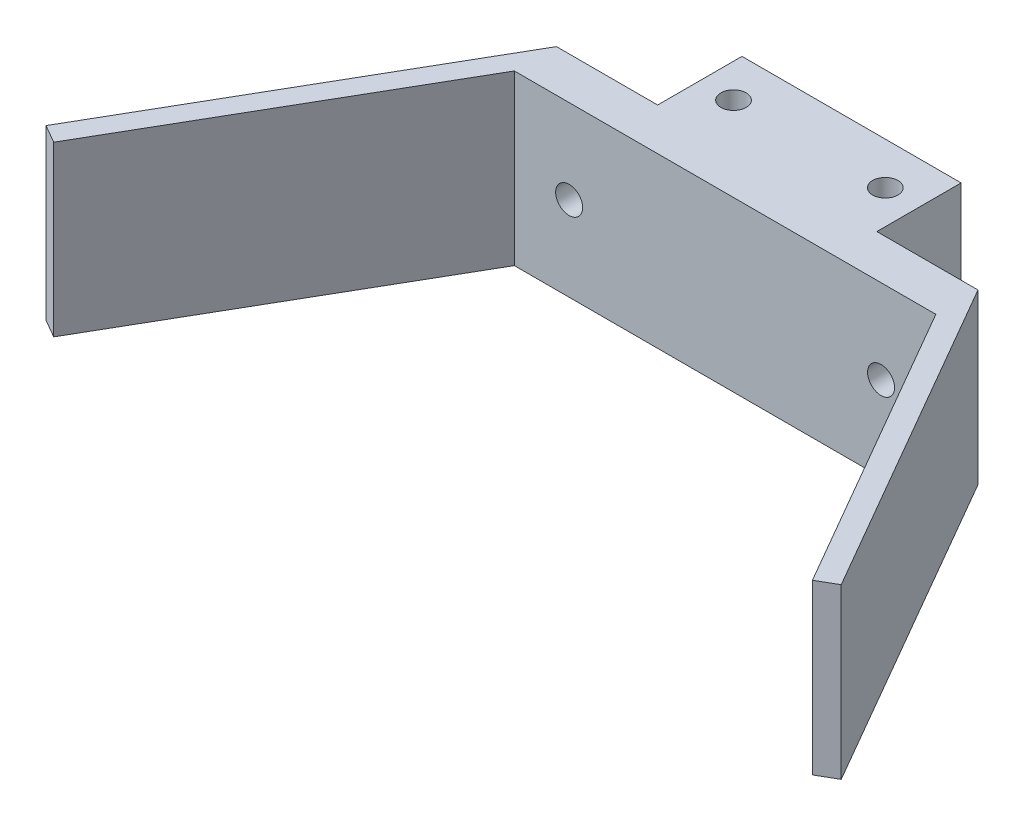
ISO-10303-21;
HEADER;
FILE_DESCRIPTION(('STEP AP214'),'2;1');
FILE_NAME('part.step','',(''),(''),'','','');
FILE_SCHEMA(('AUTOMOTIVE_DESIGN { 1 0 10303 214 1 1 1 1 }'));
ENDSEC;
DATA;
#1=APPLICATION_CONTEXT('core data for automotive mechanical design processes');
#2=APPLICATION_PROTOCOL_DEFINITION('international standard','automotive_design',2000,#1);
#3=PRODUCT_CONTEXT('',#1,'mechanical');
#4=PRODUCT('Part','Part','',(#3));
#5=PRODUCT_RELATED_PRODUCT_CATEGORY('part','',(#4));
#6=PRODUCT_DEFINITION_FORMATION('','',#4);
#7=PRODUCT_DEFINITION_CONTEXT('part definition',#1,'design');
#8=PRODUCT_DEFINITION('design','',#6,#7);
#9=PRODUCT_DEFINITION_SHAPE('','',#8);
#10=(LENGTH_UNIT() NAMED_UNIT(*) SI_UNIT(.MILLI.,.METRE.));
#11=(NAMED_UNIT(*) PLANE_ANGLE_UNIT() SI_UNIT($,.RADIAN.));
#12=(NAMED_UNIT(*) SI_UNIT($,.STERADIAN.) SOLID_ANGLE_UNIT());
#13=UNCERTAINTY_MEASURE_WITH_UNIT(LENGTH_MEASURE(1.E-05),#10,'distance_accuracy_value','');
#14=(GEOMETRIC_REPRESENTATION_CONTEXT(3) GLOBAL_UNCERTAINTY_ASSIGNED_CONTEXT((#13)) GLOBAL_UNIT_ASSIGNED_CONTEXT((#10,
#11,#12)) REPRESENTATION_CONTEXT('',''));
#15=CARTESIAN_POINT('',(0.,0.,0.));
#16=DIRECTION('',(0.,0.,1.));
#17=DIRECTION('',(1.,0.,0.));
#18=AXIS2_PLACEMENT_3D('',#15,#16,#17);
#19=CARTESIAN_POINT('',(25.,10.,0.));
#20=DIRECTION('',(0.,0.,-1.));
#21=DIRECTION('',(-1.,0.,0.));
#22=AXIS2_PLACEMENT_3D('',#19,#20,#21);
#23=PLANE('',#22);
#24=CARTESIAN_POINT('',(18.5,0.,0.));
#25=DIRECTION('',(0.,0.,1.));
#26=DIRECTION('',(-1.,0.,0.));
#27=AXIS2_PLACEMENT_3D('',#24,#25,#26);
#28=CIRCLE('',#27,1.6);
#29=CARTESIAN_POINT('',(16.9,0.,0.));
#30=VERTEX_POINT('',#29);
#31=EDGE_CURVE('E210',#30,#30,#28,.T.);
#32=ORIENTED_EDGE('',*,*,#31,.T.);
#33=EDGE_LOOP('',(#32));
#34=FACE_BOUND('',#33,.T.);
#35=DIRECTION('',(1.,0.,0.));
#36=VECTOR('',#35,1.);
#37=CARTESIAN_POINT('',(-25.,-10.,0.));
#38=LINE('',#37,#36);
#39=CARTESIAN_POINT('',(13.,-10.,0.));
#40=VERTEX_POINT('',#39);
#41=CARTESIAN_POINT('',(25.,-10.,0.));
#42=VERTEX_POINT('',#41);
#43=EDGE_CURVE('E242',#40,#42,#38,.T.);
#44=ORIENTED_EDGE('',*,*,#43,.F.);
#45=DIRECTION('',(0.,1.,0.));
#46=VECTOR('',#45,1.);
#47=CARTESIAN_POINT('',(13.,-10.,0.));
#48=LINE('',#47,#46);
#49=CARTESIAN_POINT('',(13.,10.,0.));
#50=VERTEX_POINT('',#49);
#51=EDGE_CURVE('E150',#40,#50,#48,.T.);
#52=ORIENTED_EDGE('',*,*,#51,.T.);
#53=DIRECTION('',(-1.,0.,0.));
#54=VECTOR('',#53,1.);
#55=CARTESIAN_POINT('',(-25.,10.,0.));
#56=LINE('',#55,#54);
#57=CARTESIAN_POINT('',(25.,10.,0.));
#58=VERTEX_POINT('',#57);
#59=EDGE_CURVE('E239',#58,#50,#56,.T.);
#60=ORIENTED_EDGE('',*,*,#59,.F.);
#61=DIRECTION('',(0.,1.,0.));
#62=VECTOR('',#61,1.);
#63=CARTESIAN_POINT('',(25.,-10.,0.));
#64=LINE('',#63,#62);
#65=EDGE_CURVE('E221',#42,#58,#64,.T.);
#66=ORIENTED_EDGE('',*,*,#65,.F.);
#67=EDGE_LOOP('',(#44,#52,#60,#66));
#68=FACE_BOUND('',#67,.T.);
#69=ADVANCED_FACE('F31',(#34,#68),#23,.T.);
#70=CARTESIAN_POINT('',(25.,10.,5.));
#71=DIRECTION('',(0.,0.,-1.));
#72=DIRECTION('',(-1.,0.,0.));
#73=AXIS2_PLACEMENT_3D('',#70,#71,#72);
#74=PLANE('',#73);
#75=CARTESIAN_POINT('',(-18.5,0.,5.));
#76=DIRECTION('',(0.,0.,1.));
#77=DIRECTION('',(1.,0.,0.));
#78=AXIS2_PLACEMENT_3D('',#75,#76,#77);
#79=CIRCLE('',#78,1.6);
#80=CARTESIAN_POINT('',(-16.9,0.,5.));
#81=VERTEX_POINT('',#80);
#82=EDGE_CURVE('E218',#81,#81,#79,.T.);
#83=ORIENTED_EDGE('',*,*,#82,.F.);
#84=EDGE_LOOP('',(#83));
#85=FACE_BOUND('',#84,.T.);
#86=DIRECTION('',(0.,1.,0.));
#87=VECTOR('',#86,1.);
#88=CARTESIAN_POINT('',(25.,-10.,5.));
#89=LINE('',#88,#87);
#90=CARTESIAN_POINT('',(25.,-10.,5.));
#91=VERTEX_POINT('',#90);
#92=CARTESIAN_POINT('',(25.,10.,5.));
#93=VERTEX_POINT('',#92);
#94=EDGE_CURVE('E224',#91,#93,#89,.T.);
#95=ORIENTED_EDGE('',*,*,#94,.T.);
#96=DIRECTION('',(-1.,0.,0.));
#97=VECTOR('',#96,1.);
#98=CARTESIAN_POINT('',(-25.,10.,5.));
#99=LINE('',#98,#97);
#100=CARTESIAN_POINT('',(-25.,10.,5.));
#101=VERTEX_POINT('',#100);
#102=EDGE_CURVE('E79',#93,#101,#99,.T.);
#103=ORIENTED_EDGE('',*,*,#102,.T.);
#104=DIRECTION('',(0.,-1.,0.));
#105=VECTOR('',#104,1.);
#106=CARTESIAN_POINT('',(-25.,-10.,5.));
#107=LINE('',#106,#105);
#108=CARTESIAN_POINT('',(-25.,-10.,5.));
#109=VERTEX_POINT('',#108);
#110=EDGE_CURVE('E40',#101,#109,#107,.T.);
#111=ORIENTED_EDGE('',*,*,#110,.T.);
#112=DIRECTION('',(1.,0.,0.));
#113=VECTOR('',#112,1.);
#114=CARTESIAN_POINT('',(-25.,-10.,5.));
#115=LINE('',#114,#113);
#116=EDGE_CURVE('E11',#109,#91,#115,.T.);
#117=ORIENTED_EDGE('',*,*,#116,.T.);
#118=EDGE_LOOP('',(#95,#103,#111,#117));
#119=FACE_BOUND('',#118,.T.);
#120=CARTESIAN_POINT('',(18.5,0.,5.));
#121=DIRECTION('',(0.,0.,1.));
#122=DIRECTION('',(-1.,0.,0.));
#123=AXIS2_PLACEMENT_3D('',#120,#121,#122);
#124=CIRCLE('',#123,1.6);
#125=CARTESIAN_POINT('',(16.9,0.,5.));
#126=VERTEX_POINT('',#125);
#127=EDGE_CURVE('E212',#126,#126,#124,.T.);
#128=ORIENTED_EDGE('',*,*,#127,.F.);
#129=EDGE_LOOP('',(#128));
#130=FACE_BOUND('',#129,.T.);
#131=ADVANCED_FACE('F271',(#85,#119,#130),#74,.F.);
#132=DIRECTION('',(0.,1.,0.));
#133=VECTOR('',#132,1.);
#134=CARTESIAN_POINT('',(-13.,-10.,0.));
#135=LINE('',#134,#133);
#136=CARTESIAN_POINT('',(-13.,-10.,0.));
#137=VERTEX_POINT('',#136);
#138=CARTESIAN_POINT('',(-13.,10.,0.));
#139=VERTEX_POINT('',#138);
#140=EDGE_CURVE('E160',#137,#139,#135,.T.);
#141=ORIENTED_EDGE('',*,*,#140,.F.);
#142=CARTESIAN_POINT('',(-25.,-10.,0.));
#143=VERTEX_POINT('',#142);
#144=EDGE_CURVE('E71',#143,#137,#38,.T.);
#145=ORIENTED_EDGE('',*,*,#144,.F.);
#146=DIRECTION('',(0.,-1.,0.));
#147=VECTOR('',#146,1.);
#148=CARTESIAN_POINT('',(-25.,-10.,0.));
#149=LINE('',#148,#147);
#150=CARTESIAN_POINT('',(-25.,10.,0.));
#151=VERTEX_POINT('',#150);
#152=EDGE_CURVE('E233',#151,#143,#149,.T.);
#153=ORIENTED_EDGE('',*,*,#152,.F.);
#154=EDGE_CURVE('E230',#139,#151,#56,.T.);
#155=ORIENTED_EDGE('',*,*,#154,.F.);
#156=EDGE_LOOP('',(#141,#145,#153,#155));
#157=FACE_BOUND('',#156,.T.);
#158=CARTESIAN_POINT('',(-18.5,0.,0.));
#159=DIRECTION('',(0.,0.,1.));
#160=DIRECTION('',(1.,0.,0.));
#161=AXIS2_PLACEMENT_3D('',#158,#159,#160);
#162=CIRCLE('',#161,1.6);
#163=CARTESIAN_POINT('',(-16.9,0.,0.));
#164=VERTEX_POINT('',#163);
#165=EDGE_CURVE('E215',#164,#164,#162,.T.);
#166=ORIENTED_EDGE('',*,*,#165,.T.);
#167=EDGE_LOOP('',(#166));
#168=FACE_BOUND('',#167,.T.);
#169=ADVANCED_FACE('F253',(#157,#168),#23,.T.);
#170=CARTESIAN_POINT('',(-25.,10.,5.));
#171=DIRECTION('',(0.,-1.,0.));
#172=DIRECTION('',(0.,0.,-1.));
#173=AXIS2_PLACEMENT_3D('',#170,#171,#172);
#174=PLANE('',#173);
#175=ORIENTED_EDGE('',*,*,#59,.T.);
#176=DIRECTION('',(0.,0.,-1.));
#177=VECTOR('',#176,1.);
#178=CARTESIAN_POINT('',(13.,10.,-10.));
#179=LINE('',#178,#177);
#180=CARTESIAN_POINT('',(13.,10.,-10.));
#181=VERTEX_POINT('',#180);
#182=EDGE_CURVE('E48',#50,#181,#179,.T.);
#183=ORIENTED_EDGE('',*,*,#182,.T.);
#184=DIRECTION('',(-1.,0.,0.));
#185=VECTOR('',#184,1.);
#186=CARTESIAN_POINT('',(-13.,10.,-10.));
#187=LINE('',#186,#185);
#188=CARTESIAN_POINT('',(-13.,10.,-10.));
#189=VERTEX_POINT('',#188);
#190=EDGE_CURVE('E136',#181,#189,#187,.T.);
#191=ORIENTED_EDGE('',*,*,#190,.T.);
#192=DIRECTION('',(0.,0.,1.));
#193=VECTOR('',#192,1.);
#194=CARTESIAN_POINT('',(-13.,10.,-10.));
#195=LINE('',#194,#193);
#196=EDGE_CURVE('E151',#189,#139,#195,.T.);
#197=ORIENTED_EDGE('',*,*,#196,.T.);
#198=ORIENTED_EDGE('',*,*,#154,.T.);
#199=DIRECTION('',(-0.500000000000001,0.,0.866025403784438));
#200=VECTOR('',#199,1.);
#201=CARTESIAN_POINT('',(-47.1650635094612,10.,38.3910161513775));
#202=LINE('',#201,#200);
#203=CARTESIAN_POINT('',(-47.1650635094612,10.,38.3910161513775));
#204=VERTEX_POINT('',#203);
#205=EDGE_CURVE('E182',#151,#204,#202,.T.);
#206=ORIENTED_EDGE('',*,*,#205,.T.);
#207=DIRECTION('',(0.866025403784438,0.,0.500000000000002));
#208=VECTOR('',#207,1.);
#209=CARTESIAN_POINT('',(-45.0000000000001,10.,39.6410161513775));
#210=LINE('',#209,#208);
#211=CARTESIAN_POINT('',(-45.0000000000001,10.,39.6410161513775));
#212=VERTEX_POINT('',#211);
#213=EDGE_CURVE('E173',#204,#212,#210,.T.);
#214=ORIENTED_EDGE('',*,*,#213,.T.);
#215=DIRECTION('',(0.500000000000001,0.,-0.866025403784438));
#216=VECTOR('',#215,1.);
#217=CARTESIAN_POINT('',(-25.,10.,5.));
#218=LINE('',#217,#216);
#219=EDGE_CURVE('E180',#212,#101,#218,.T.);
#220=ORIENTED_EDGE('',*,*,#219,.T.);
#221=ORIENTED_EDGE('',*,*,#102,.F.);
#222=DIRECTION('',(0.500000000000001,0.,0.866025403784438));
#223=VECTOR('',#222,1.);
#224=CARTESIAN_POINT('',(25.,10.,5.));
#225=LINE('',#224,#223);
#226=CARTESIAN_POINT('',(45.0000000000001,10.,39.6410161513775));
#227=VERTEX_POINT('',#226);
#228=EDGE_CURVE('E204',#93,#227,#225,.T.);
#229=ORIENTED_EDGE('',*,*,#228,.T.);
#230=DIRECTION('',(0.866025403784438,0.,-0.500000000000002));
#231=VECTOR('',#230,1.);
#232=CARTESIAN_POINT('',(45.0000000000001,10.,39.6410161513775));
#233=LINE('',#232,#231);
#234=CARTESIAN_POINT('',(47.1650635094612,10.,38.3910161513775));
#235=VERTEX_POINT('',#234);
#236=EDGE_CURVE('E195',#227,#235,#233,.T.);
#237=ORIENTED_EDGE('',*,*,#236,.T.);
#238=DIRECTION('',(-0.500000000000001,0.,-0.866025403784438));
#239=VECTOR('',#238,1.);
#240=CARTESIAN_POINT('',(47.1650635094612,10.,38.3910161513775));
#241=LINE('',#240,#239);
#242=EDGE_CURVE('E189',#235,#58,#241,.T.);
#243=ORIENTED_EDGE('',*,*,#242,.T.);
#244=EDGE_LOOP('',(#175,#183,#191,#197,#198,#206,#214,#220,#221,#229,#237,#243));
#245=FACE_BOUND('',#244,.T.);
#246=CARTESIAN_POINT('',(9.,10.,-5.));
#247=DIRECTION('',(0.,1.,0.));
#248=DIRECTION('',(0.,0.,-1.));
#249=AXIS2_PLACEMENT_3D('',#246,#247,#248);
#250=CIRCLE('',#249,1.5);
#251=CARTESIAN_POINT('',(9.,10.,-6.50000000000001));
#252=VERTEX_POINT('',#251);
#253=EDGE_CURVE('E345',#252,#252,#250,.T.);
#254=ORIENTED_EDGE('',*,*,#253,.F.);
#255=EDGE_LOOP('',(#254));
#256=FACE_BOUND('',#255,.T.);
#257=CARTESIAN_POINT('',(-9.,10.,-5.));
#258=DIRECTION('',(0.,1.,0.));
#259=DIRECTION('',(0.,0.,1.));
#260=AXIS2_PLACEMENT_3D('',#257,#258,#259);
#261=CIRCLE('',#260,1.5);
#262=CARTESIAN_POINT('',(-9.,10.,-3.5));
#263=VERTEX_POINT('',#262);
#264=EDGE_CURVE('E336',#263,#263,#261,.T.);
#265=ORIENTED_EDGE('',*,*,#264,.F.);
#266=EDGE_LOOP('',(#265));
#267=FACE_BOUND('',#266,.T.);
#268=ADVANCED_FACE('F33',(#245,#256,#267),#174,.F.);
#269=CARTESIAN_POINT('',(-25.,-10.,5.));
#270=DIRECTION('',(0.,1.,0.));
#271=DIRECTION('',(0.,0.,1.));
#272=AXIS2_PLACEMENT_3D('',#269,#270,#271);
#273=PLANE('',#272);
#274=ORIENTED_EDGE('',*,*,#144,.T.);
#275=DIRECTION('',(0.,0.,1.));
#276=VECTOR('',#275,1.);
#277=CARTESIAN_POINT('',(-13.,-10.,-10.));
#278=LINE('',#277,#276);
#279=CARTESIAN_POINT('',(-13.,-10.,-10.));
#280=VERTEX_POINT('',#279);
#281=EDGE_CURVE('E139',#280,#137,#278,.T.);
#282=ORIENTED_EDGE('',*,*,#281,.F.);
#283=DIRECTION('',(-1.,0.,0.));
#284=VECTOR('',#283,1.);
#285=CARTESIAN_POINT('',(-13.,-10.,-10.));
#286=LINE('',#285,#284);
#287=CARTESIAN_POINT('',(13.,-10.,-10.));
#288=VERTEX_POINT('',#287);
#289=EDGE_CURVE('E134',#288,#280,#286,.T.);
#290=ORIENTED_EDGE('',*,*,#289,.F.);
#291=DIRECTION('',(0.,0.,-1.));
#292=VECTOR('',#291,1.);
#293=CARTESIAN_POINT('',(13.,-10.,-10.));
#294=LINE('',#293,#292);
#295=EDGE_CURVE('E146',#40,#288,#294,.T.);
#296=ORIENTED_EDGE('',*,*,#295,.F.);
#297=ORIENTED_EDGE('',*,*,#43,.T.);
#298=DIRECTION('',(-0.500000000000001,0.,-0.866025403784438));
#299=VECTOR('',#298,1.);
#300=CARTESIAN_POINT('',(47.1650635094612,-10.,38.3910161513775));
#301=LINE('',#300,#299);
#302=CARTESIAN_POINT('',(47.1650635094612,-10.,38.3910161513775));
#303=VERTEX_POINT('',#302);
#304=EDGE_CURVE('E191',#303,#42,#301,.T.);
#305=ORIENTED_EDGE('',*,*,#304,.F.);
#306=DIRECTION('',(0.866025403784438,0.,-0.500000000000002));
#307=VECTOR('',#306,1.);
#308=CARTESIAN_POINT('',(45.0000000000001,-10.,39.6410161513775));
#309=LINE('',#308,#307);
#310=CARTESIAN_POINT('',(45.0000000000001,-10.,39.6410161513775));
#311=VERTEX_POINT('',#310);
#312=EDGE_CURVE('E198',#311,#303,#309,.T.);
#313=ORIENTED_EDGE('',*,*,#312,.F.);
#314=DIRECTION('',(0.500000000000001,0.,0.866025403784438));
#315=VECTOR('',#314,1.);
#316=CARTESIAN_POINT('',(25.,-10.,5.));
#317=LINE('',#316,#315);
#318=EDGE_CURVE('E194',#91,#311,#317,.T.);
#319=ORIENTED_EDGE('',*,*,#318,.F.);
#320=ORIENTED_EDGE('',*,*,#116,.F.);
#321=DIRECTION('',(0.500000000000001,0.,-0.866025403784438));
#322=VECTOR('',#321,1.);
#323=CARTESIAN_POINT('',(-25.,-10.,5.));
#324=LINE('',#323,#322);
#325=CARTESIAN_POINT('',(-45.0000000000001,-10.,39.6410161513775));
#326=VERTEX_POINT('',#325);
#327=EDGE_CURVE('E169',#326,#109,#324,.T.);
#328=ORIENTED_EDGE('',*,*,#327,.F.);
#329=DIRECTION('',(0.866025403784438,0.,0.500000000000002));
#330=VECTOR('',#329,1.);
#331=CARTESIAN_POINT('',(-45.0000000000001,-10.,39.6410161513775));
#332=LINE('',#331,#330);
#333=CARTESIAN_POINT('',(-47.1650635094612,-10.,38.3910161513775));
#334=VERTEX_POINT('',#333);
#335=EDGE_CURVE('E176',#334,#326,#332,.T.);
#336=ORIENTED_EDGE('',*,*,#335,.F.);
#337=DIRECTION('',(-0.500000000000001,0.,0.866025403784438));
#338=VECTOR('',#337,1.);
#339=CARTESIAN_POINT('',(-47.1650635094612,-10.,38.3910161513775));
#340=LINE('',#339,#338);
#341=EDGE_CURVE('E172',#143,#334,#340,.T.);
#342=ORIENTED_EDGE('',*,*,#341,.F.);
#343=EDGE_LOOP('',(#274,#282,#290,#296,#297,#305,#313,#319,#320,#328,#336,#342));
#344=FACE_BOUND('',#343,.T.);
#345=CARTESIAN_POINT('',(9.,-10.,-5.));
#346=DIRECTION('',(0.,1.,0.));
#347=DIRECTION('',(0.,0.,-1.));
#348=AXIS2_PLACEMENT_3D('',#345,#346,#347);
#349=CIRCLE('',#348,1.5);
#350=CARTESIAN_POINT('',(9.,-10.,-6.50000000000001));
#351=VERTEX_POINT('',#350);
#352=EDGE_CURVE('E342',#351,#351,#349,.T.);
#353=ORIENTED_EDGE('',*,*,#352,.T.);
#354=EDGE_LOOP('',(#353));
#355=FACE_BOUND('',#354,.T.);
#356=CARTESIAN_POINT('',(-9.,-10.,-5.));
#357=DIRECTION('',(0.,1.,0.));
#358=DIRECTION('',(0.,0.,1.));
#359=AXIS2_PLACEMENT_3D('',#356,#357,#358);
#360=CIRCLE('',#359,1.5);
#361=CARTESIAN_POINT('',(-9.,-10.,-3.5));
#362=VERTEX_POINT('',#361);
#363=EDGE_CURVE('E334',#362,#362,#360,.T.);
#364=ORIENTED_EDGE('',*,*,#363,.T.);
#365=EDGE_LOOP('',(#364));
#366=FACE_BOUND('',#365,.T.);
#367=ADVANCED_FACE('F144',(#344,#355,#366),#273,.F.);
#368=CARTESIAN_POINT('',(-18.5,0.,5.));
#369=DIRECTION('',(0.,0.,-1.));
#370=DIRECTION('',(-1.,0.,0.));
#371=AXIS2_PLACEMENT_3D('',#368,#369,#370);
#372=CYLINDRICAL_SURFACE('',#371,1.6);
#373=ORIENTED_EDGE('',*,*,#82,.T.);
#374=EDGE_LOOP('',(#373));
#375=FACE_BOUND('',#374,.T.);
#376=ORIENTED_EDGE('',*,*,#165,.F.);
#377=EDGE_LOOP('',(#376));
#378=FACE_BOUND('',#377,.T.);
#379=ADVANCED_FACE('F287',(#375,#378),#372,.F.);
#380=CARTESIAN_POINT('',(18.5,0.,5.));
#381=DIRECTION('',(0.,0.,-1.));
#382=DIRECTION('',(-1.,0.,0.));
#383=AXIS2_PLACEMENT_3D('',#380,#381,#382);
#384=CYLINDRICAL_SURFACE('',#383,1.6);
#385=ORIENTED_EDGE('',*,*,#127,.T.);
#386=EDGE_LOOP('',(#385));
#387=FACE_BOUND('',#386,.T.);
#388=ORIENTED_EDGE('',*,*,#31,.F.);
#389=EDGE_LOOP('',(#388));
#390=FACE_BOUND('',#389,.T.);
#391=ADVANCED_FACE('F291',(#387,#390),#384,.F.);
#392=CARTESIAN_POINT('',(47.1650635094612,-10.,38.3910161513775));
#393=DIRECTION('',(0.866025403784438,0.,-0.500000000000001));
#394=DIRECTION('',(-0.500000000000001,0.,-0.866025403784438));
#395=AXIS2_PLACEMENT_3D('',#392,#393,#394);
#396=PLANE('',#395);
#397=ORIENTED_EDGE('',*,*,#242,.F.);
#398=DIRECTION('',(0.,1.,0.));
#399=VECTOR('',#398,1.);
#400=CARTESIAN_POINT('',(47.1650635094612,-10.,38.3910161513775));
#401=LINE('',#400,#399);
#402=EDGE_CURVE('E208',#303,#235,#401,.T.);
#403=ORIENTED_EDGE('',*,*,#402,.F.);
#404=ORIENTED_EDGE('',*,*,#304,.T.);
#405=ORIENTED_EDGE('',*,*,#65,.T.);
#406=EDGE_LOOP('',(#397,#403,#404,#405));
#407=FACE_BOUND('',#406,.T.);
#408=ADVANCED_FACE('F297',(#407),#396,.T.);
#409=CARTESIAN_POINT('',(45.0000000000001,-10.,39.6410161513775));
#410=DIRECTION('',(0.500000000000002,0.,0.866025403784438));
#411=DIRECTION('',(0.866025403784438,0.,-0.500000000000002));
#412=AXIS2_PLACEMENT_3D('',#409,#410,#411);
#413=PLANE('',#412);
#414=ORIENTED_EDGE('',*,*,#236,.F.);
#415=DIRECTION('',(0.,1.,0.));
#416=VECTOR('',#415,1.);
#417=CARTESIAN_POINT('',(45.0000000000001,-10.,39.6410161513775));
#418=LINE('',#417,#416);
#419=EDGE_CURVE('E201',#311,#227,#418,.T.);
#420=ORIENTED_EDGE('',*,*,#419,.F.);
#421=ORIENTED_EDGE('',*,*,#312,.T.);
#422=ORIENTED_EDGE('',*,*,#402,.T.);
#423=EDGE_LOOP('',(#414,#420,#421,#422));
#424=FACE_BOUND('',#423,.T.);
#425=ADVANCED_FACE('F304',(#424),#413,.T.);
#426=CARTESIAN_POINT('',(25.,-10.,5.));
#427=DIRECTION('',(-0.866025403784438,0.,0.500000000000001));
#428=DIRECTION('',(0.500000000000001,0.,0.866025403784438));
#429=AXIS2_PLACEMENT_3D('',#426,#427,#428);
#430=PLANE('',#429);
#431=ORIENTED_EDGE('',*,*,#228,.F.);
#432=ORIENTED_EDGE('',*,*,#94,.F.);
#433=ORIENTED_EDGE('',*,*,#318,.T.);
#434=ORIENTED_EDGE('',*,*,#419,.T.);
#435=EDGE_LOOP('',(#431,#432,#433,#434));
#436=FACE_BOUND('',#435,.T.);
#437=ADVANCED_FACE('F306',(#436),#430,.T.);
#438=CARTESIAN_POINT('',(-25.,-10.,5.));
#439=DIRECTION('',(0.866025403784438,0.,0.500000000000001));
#440=DIRECTION('',(0.500000000000001,0.,-0.866025403784438));
#441=AXIS2_PLACEMENT_3D('',#438,#439,#440);
#442=PLANE('',#441);
#443=ORIENTED_EDGE('',*,*,#219,.F.);
#444=DIRECTION('',(0.,1.,0.));
#445=VECTOR('',#444,1.);
#446=CARTESIAN_POINT('',(-45.0000000000001,-10.,39.6410161513775));
#447=LINE('',#446,#445);
#448=EDGE_CURVE('E187',#326,#212,#447,.T.);
#449=ORIENTED_EDGE('',*,*,#448,.F.);
#450=ORIENTED_EDGE('',*,*,#327,.T.);
#451=ORIENTED_EDGE('',*,*,#110,.F.);
#452=EDGE_LOOP('',(#443,#449,#450,#451));
#453=FACE_BOUND('',#452,.T.);
#454=ADVANCED_FACE('F309',(#453),#442,.T.);
#455=CARTESIAN_POINT('',(-45.0000000000001,-10.,39.6410161513775));
#456=DIRECTION('',(-0.500000000000002,0.,0.866025403784438));
#457=DIRECTION('',(0.866025403784438,0.,0.500000000000002));
#458=AXIS2_PLACEMENT_3D('',#455,#456,#457);
#459=PLANE('',#458);
#460=ORIENTED_EDGE('',*,*,#213,.F.);
#461=DIRECTION('',(0.,1.,0.));
#462=VECTOR('',#461,1.);
#463=CARTESIAN_POINT('',(-47.1650635094612,-10.,38.3910161513775));
#464=LINE('',#463,#462);
#465=EDGE_CURVE('E179',#334,#204,#464,.T.);
#466=ORIENTED_EDGE('',*,*,#465,.F.);
#467=ORIENTED_EDGE('',*,*,#335,.T.);
#468=ORIENTED_EDGE('',*,*,#448,.T.);
#469=EDGE_LOOP('',(#460,#466,#467,#468));
#470=FACE_BOUND('',#469,.T.);
#471=ADVANCED_FACE('F316',(#470),#459,.T.);
#472=CARTESIAN_POINT('',(-47.1650635094612,-10.,38.3910161513775));
#473=DIRECTION('',(-0.866025403784438,0.,-0.500000000000001));
#474=DIRECTION('',(-0.500000000000001,0.,0.866025403784438));
#475=AXIS2_PLACEMENT_3D('',#472,#473,#474);
#476=PLANE('',#475);
#477=ORIENTED_EDGE('',*,*,#205,.F.);
#478=ORIENTED_EDGE('',*,*,#152,.T.);
#479=ORIENTED_EDGE('',*,*,#341,.T.);
#480=ORIENTED_EDGE('',*,*,#465,.T.);
#481=EDGE_LOOP('',(#477,#478,#479,#480));
#482=FACE_BOUND('',#481,.T.);
#483=ADVANCED_FACE('F251',(#482),#476,.T.);
#484=CARTESIAN_POINT('',(13.,-10.,-10.));
#485=DIRECTION('',(1.,0.,0.));
#486=DIRECTION('',(0.,0.,-1.));
#487=AXIS2_PLACEMENT_3D('',#484,#485,#486);
#488=PLANE('',#487);
#489=ORIENTED_EDGE('',*,*,#182,.F.);
#490=ORIENTED_EDGE('',*,*,#51,.F.);
#491=ORIENTED_EDGE('',*,*,#295,.T.);
#492=DIRECTION('',(0.,1.,0.));
#493=VECTOR('',#492,1.);
#494=CARTESIAN_POINT('',(13.,-10.,-10.));
#495=LINE('',#494,#493);
#496=EDGE_CURVE('E131',#288,#181,#495,.T.);
#497=ORIENTED_EDGE('',*,*,#496,.T.);
#498=EDGE_LOOP('',(#489,#490,#491,#497));
#499=FACE_BOUND('',#498,.T.);
#500=ADVANCED_FACE('F149',(#499),#488,.T.);
#501=CARTESIAN_POINT('',(-13.,-10.,-10.));
#502=DIRECTION('',(-1.,0.,0.));
#503=DIRECTION('',(0.,0.,1.));
#504=AXIS2_PLACEMENT_3D('',#501,#502,#503);
#505=PLANE('',#504);
#506=ORIENTED_EDGE('',*,*,#196,.F.);
#507=DIRECTION('',(0.,1.,0.));
#508=VECTOR('',#507,1.);
#509=CARTESIAN_POINT('',(-13.,-10.,-10.));
#510=LINE('',#509,#508);
#511=EDGE_CURVE('E138',#280,#189,#510,.T.);
#512=ORIENTED_EDGE('',*,*,#511,.F.);
#513=ORIENTED_EDGE('',*,*,#281,.T.);
#514=ORIENTED_EDGE('',*,*,#140,.T.);
#515=EDGE_LOOP('',(#506,#512,#513,#514));
#516=FACE_BOUND('',#515,.T.);
#517=ADVANCED_FACE('F259',(#516),#505,.T.);
#518=CARTESIAN_POINT('',(-13.,-10.,-10.));
#519=DIRECTION('',(0.,0.,-1.));
#520=DIRECTION('',(-1.,0.,0.));
#521=AXIS2_PLACEMENT_3D('',#518,#519,#520);
#522=PLANE('',#521);
#523=ORIENTED_EDGE('',*,*,#190,.F.);
#524=ORIENTED_EDGE('',*,*,#496,.F.);
#525=ORIENTED_EDGE('',*,*,#289,.T.);
#526=ORIENTED_EDGE('',*,*,#511,.T.);
#527=EDGE_LOOP('',(#523,#524,#525,#526));
#528=FACE_BOUND('',#527,.T.);
#529=ADVANCED_FACE('F133',(#528),#522,.T.);
#530=CARTESIAN_POINT('',(-9.,-10.,-5.));
#531=DIRECTION('',(0.,1.,0.));
#532=DIRECTION('',(0.,0.,1.));
#533=AXIS2_PLACEMENT_3D('',#530,#531,#532);
#534=CYLINDRICAL_SURFACE('',#533,1.5);
#535=ORIENTED_EDGE('',*,*,#363,.F.);
#536=EDGE_LOOP('',(#535));
#537=FACE_BOUND('',#536,.T.);
#538=ORIENTED_EDGE('',*,*,#264,.T.);
#539=EDGE_LOOP('',(#538));
#540=FACE_BOUND('',#539,.T.);
#541=ADVANCED_FACE('F266',(#537,#540),#534,.F.);
#542=CARTESIAN_POINT('',(9.,-10.,-5.));
#543=DIRECTION('',(0.,1.,0.));
#544=DIRECTION('',(0.,0.,1.));
#545=AXIS2_PLACEMENT_3D('',#542,#543,#544);
#546=CYLINDRICAL_SURFACE('',#545,1.5);
#547=ORIENTED_EDGE('',*,*,#352,.F.);
#548=EDGE_LOOP('',(#547));
#549=FACE_BOUND('',#548,.T.);
#550=ORIENTED_EDGE('',*,*,#253,.T.);
#551=EDGE_LOOP('',(#550));
#552=FACE_BOUND('',#551,.T.);
#553=ADVANCED_FACE('F351',(#549,#552),#546,.F.);
#554=CLOSED_SHELL('',(#69,#131,#169,#268,#367,#379,#391,#408,#425,#437,#454,#471,#483,#500,#517,
#529,#541,#553));
#555=MANIFOLD_SOLID_BREP('B2',#554);
#556=ADVANCED_BREP_SHAPE_REPRESENTATION('',(#18,#555),#14);
#557=SHAPE_DEFINITION_REPRESENTATION(#9,#556);
ENDSEC;
END-ISO-10303-21;
